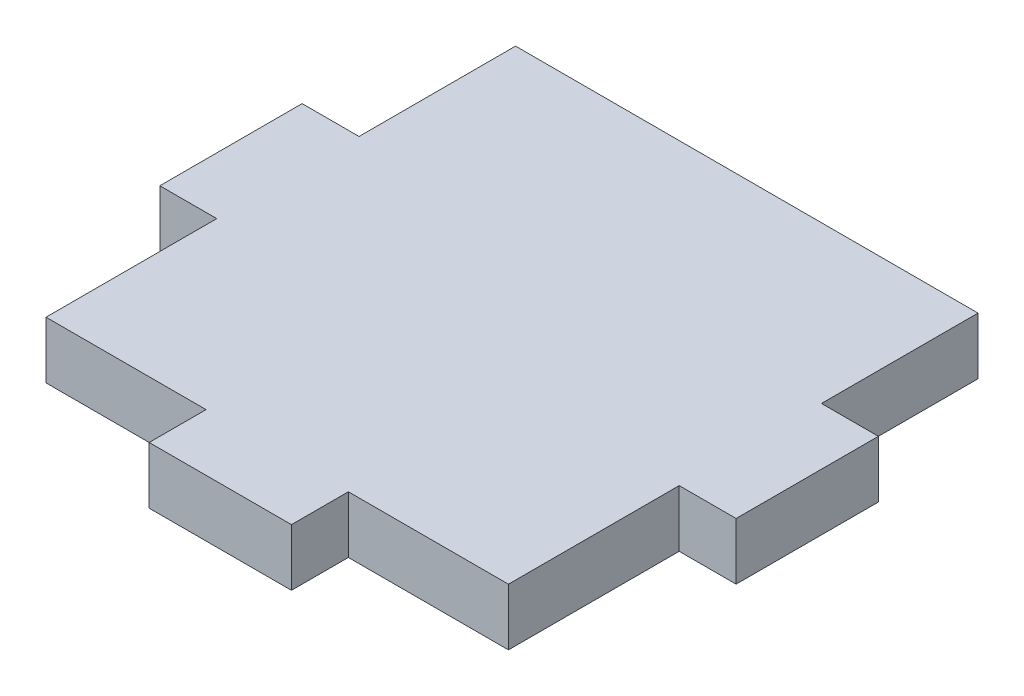
ISO-10303-21;
HEADER;
FILE_DESCRIPTION(('STEP AP214'),'2;1');
FILE_NAME('part.step','',(''),(''),'','','');
FILE_SCHEMA(('AUTOMOTIVE_DESIGN { 1 0 10303 214 1 1 1 1 }'));
ENDSEC;
DATA;
#1=APPLICATION_CONTEXT('core data for automotive mechanical design processes');
#2=APPLICATION_PROTOCOL_DEFINITION('international standard','automotive_design',2000,#1);
#3=PRODUCT_CONTEXT('',#1,'mechanical');
#4=PRODUCT('Part','Part','',(#3));
#5=PRODUCT_RELATED_PRODUCT_CATEGORY('part','',(#4));
#6=PRODUCT_DEFINITION_FORMATION('','',#4);
#7=PRODUCT_DEFINITION_CONTEXT('part definition',#1,'design');
#8=PRODUCT_DEFINITION('design','',#6,#7);
#9=PRODUCT_DEFINITION_SHAPE('','',#8);
#10=(LENGTH_UNIT() NAMED_UNIT(*) SI_UNIT(.MILLI.,.METRE.));
#11=(NAMED_UNIT(*) PLANE_ANGLE_UNIT() SI_UNIT($,.RADIAN.));
#12=(NAMED_UNIT(*) SI_UNIT($,.STERADIAN.) SOLID_ANGLE_UNIT());
#13=UNCERTAINTY_MEASURE_WITH_UNIT(LENGTH_MEASURE(1.E-05),#10,'distance_accuracy_value','');
#14=(GEOMETRIC_REPRESENTATION_CONTEXT(3) GLOBAL_UNCERTAINTY_ASSIGNED_CONTEXT((#13)) GLOBAL_UNIT_ASSIGNED_CONTEXT((#10,
#11,#12)) REPRESENTATION_CONTEXT('',''));
#15=CARTESIAN_POINT('',(0.,0.,0.));
#16=DIRECTION('',(0.,0.,1.));
#17=DIRECTION('',(1.,0.,0.));
#18=AXIS2_PLACEMENT_3D('',#15,#16,#17);
#19=CARTESIAN_POINT('',(0.,4.,0.));
#20=DIRECTION('',(1.,0.,0.));
#21=DIRECTION('',(0.,0.,-1.));
#22=AXIS2_PLACEMENT_3D('',#19,#20,#21);
#23=PLANE('',#22);
#24=DIRECTION('',(0.,-1.,0.));
#25=VECTOR('',#24,1.);
#26=CARTESIAN_POINT('',(0.,4.,11.));
#27=LINE('',#26,#25);
#28=CARTESIAN_POINT('',(0.,4.,11.));
#29=VERTEX_POINT('',#28);
#30=CARTESIAN_POINT('',(0.,0.,11.));
#31=VERTEX_POINT('',#30);
#32=EDGE_CURVE('E225',#29,#31,#27,.T.);
#33=ORIENTED_EDGE('',*,*,#32,.F.);
#34=DIRECTION('',(0.,0.,1.));
#35=VECTOR('',#34,1.);
#36=CARTESIAN_POINT('',(0.,4.,0.));
#37=LINE('',#36,#35);
#38=CARTESIAN_POINT('',(0.,4.,0.));
#39=VERTEX_POINT('',#38);
#40=EDGE_CURVE('E167',#39,#29,#37,.T.);
#41=ORIENTED_EDGE('',*,*,#40,.F.);
#42=DIRECTION('',(0.,-1.,0.));
#43=VECTOR('',#42,1.);
#44=CARTESIAN_POINT('',(0.,4.,0.));
#45=LINE('',#44,#43);
#46=CARTESIAN_POINT('',(0.,0.,0.));
#47=VERTEX_POINT('',#46);
#48=EDGE_CURVE('E185',#39,#47,#45,.T.);
#49=ORIENTED_EDGE('',*,*,#48,.T.);
#50=DIRECTION('',(0.,0.,1.));
#51=VECTOR('',#50,1.);
#52=CARTESIAN_POINT('',(0.,0.,0.));
#53=LINE('',#52,#51);
#54=EDGE_CURVE('E186',#47,#31,#53,.T.);
#55=ORIENTED_EDGE('',*,*,#54,.T.);
#56=EDGE_LOOP('',(#33,#41,#49,#55));
#57=FACE_BOUND('',#56,.T.);
#58=ADVANCED_FACE('F33',(#57),#23,.F.);
#59=CARTESIAN_POINT('',(32.5,4.,0.));
#60=DIRECTION('',(-1.,0.,0.));
#61=DIRECTION('',(0.,0.,1.));
#62=AXIS2_PLACEMENT_3D('',#59,#60,#61);
#63=PLANE('',#62);
#64=DIRECTION('',(0.,-1.,0.));
#65=VECTOR('',#64,1.);
#66=CARTESIAN_POINT('',(32.5,4.,21.));
#67=LINE('',#66,#65);
#68=CARTESIAN_POINT('',(32.5,4.,21.));
#69=VERTEX_POINT('',#68);
#70=CARTESIAN_POINT('',(32.5,0.,21.));
#71=VERTEX_POINT('',#70);
#72=EDGE_CURVE('E234',#69,#71,#67,.T.);
#73=ORIENTED_EDGE('',*,*,#72,.F.);
#74=DIRECTION('',(0.,0.,-1.));
#75=VECTOR('',#74,1.);
#76=CARTESIAN_POINT('',(32.5,4.,0.));
#77=LINE('',#76,#75);
#78=CARTESIAN_POINT('',(32.5,4.,33.));
#79=VERTEX_POINT('',#78);
#80=EDGE_CURVE('E180',#79,#69,#77,.T.);
#81=ORIENTED_EDGE('',*,*,#80,.F.);
#82=DIRECTION('',(0.,-1.,0.));
#83=VECTOR('',#82,1.);
#84=CARTESIAN_POINT('',(32.5,4.,33.));
#85=LINE('',#84,#83);
#86=CARTESIAN_POINT('',(32.5,0.,33.));
#87=VERTEX_POINT('',#86);
#88=EDGE_CURVE('E41',#79,#87,#85,.T.);
#89=ORIENTED_EDGE('',*,*,#88,.T.);
#90=DIRECTION('',(0.,0.,-1.));
#91=VECTOR('',#90,1.);
#92=CARTESIAN_POINT('',(32.5,0.,0.));
#93=LINE('',#92,#91);
#94=EDGE_CURVE('E171',#87,#71,#93,.T.);
#95=ORIENTED_EDGE('',*,*,#94,.T.);
#96=EDGE_LOOP('',(#73,#81,#89,#95));
#97=FACE_BOUND('',#96,.T.);
#98=ADVANCED_FACE('F207',(#97),#63,.F.);
#99=CARTESIAN_POINT('',(0.,4.,33.));
#100=DIRECTION('',(0.,0.,-1.));
#101=DIRECTION('',(-1.,0.,0.));
#102=AXIS2_PLACEMENT_3D('',#99,#100,#101);
#103=PLANE('',#102);
#104=DIRECTION('',(0.,-1.,0.));
#105=VECTOR('',#104,1.);
#106=CARTESIAN_POINT('',(11.25,4.,33.));
#107=LINE('',#106,#105);
#108=CARTESIAN_POINT('',(11.25,4.,33.));
#109=VERTEX_POINT('',#108);
#110=CARTESIAN_POINT('',(11.25,0.,33.));
#111=VERTEX_POINT('',#110);
#112=EDGE_CURVE('E257',#109,#111,#107,.T.);
#113=ORIENTED_EDGE('',*,*,#112,.F.);
#114=DIRECTION('',(1.,0.,0.));
#115=VECTOR('',#114,1.);
#116=CARTESIAN_POINT('',(0.,4.,33.));
#117=LINE('',#116,#115);
#118=CARTESIAN_POINT('',(0.,4.,33.));
#119=VERTEX_POINT('',#118);
#120=EDGE_CURVE('E177',#119,#109,#117,.T.);
#121=ORIENTED_EDGE('',*,*,#120,.F.);
#122=DIRECTION('',(0.,-1.,0.));
#123=VECTOR('',#122,1.);
#124=CARTESIAN_POINT('',(0.,4.,33.));
#125=LINE('',#124,#123);
#126=CARTESIAN_POINT('',(0.,0.,33.));
#127=VERTEX_POINT('',#126);
#128=EDGE_CURVE('E11',#119,#127,#125,.T.);
#129=ORIENTED_EDGE('',*,*,#128,.T.);
#130=DIRECTION('',(1.,0.,0.));
#131=VECTOR('',#130,1.);
#132=CARTESIAN_POINT('',(0.,0.,33.));
#133=LINE('',#132,#131);
#134=EDGE_CURVE('E191',#127,#111,#133,.T.);
#135=ORIENTED_EDGE('',*,*,#134,.T.);
#136=EDGE_LOOP('',(#113,#121,#129,#135));
#137=FACE_BOUND('',#136,.T.);
#138=ADVANCED_FACE('F271',(#137),#103,.F.);
#139=CARTESIAN_POINT('',(0.,4.,21.));
#140=VERTEX_POINT('',#139);
#141=EDGE_CURVE('E159',#140,#119,#37,.T.);
#142=ORIENTED_EDGE('',*,*,#141,.F.);
#143=DIRECTION('',(0.,-1.,0.));
#144=VECTOR('',#143,1.);
#145=CARTESIAN_POINT('',(0.,4.,21.));
#146=LINE('',#145,#144);
#147=CARTESIAN_POINT('',(0.,0.,21.));
#148=VERTEX_POINT('',#147);
#149=EDGE_CURVE('E144',#140,#148,#146,.T.);
#150=ORIENTED_EDGE('',*,*,#149,.T.);
#151=EDGE_CURVE('E190',#148,#127,#53,.T.);
#152=ORIENTED_EDGE('',*,*,#151,.T.);
#153=ORIENTED_EDGE('',*,*,#128,.F.);
#154=EDGE_LOOP('',(#142,#150,#152,#153));
#155=FACE_BOUND('',#154,.T.);
#156=ADVANCED_FACE('F35',(#155),#23,.F.);
#157=CARTESIAN_POINT('',(21.25,4.,33.));
#158=VERTEX_POINT('',#157);
#159=EDGE_CURVE('E170',#158,#79,#117,.T.);
#160=ORIENTED_EDGE('',*,*,#159,.F.);
#161=DIRECTION('',(0.,-1.,0.));
#162=VECTOR('',#161,1.);
#163=CARTESIAN_POINT('',(21.25,4.,33.));
#164=LINE('',#163,#162);
#165=CARTESIAN_POINT('',(21.25,0.,33.));
#166=VERTEX_POINT('',#165);
#167=EDGE_CURVE('E254',#158,#166,#164,.T.);
#168=ORIENTED_EDGE('',*,*,#167,.T.);
#169=EDGE_CURVE('E189',#166,#87,#133,.T.);
#170=ORIENTED_EDGE('',*,*,#169,.T.);
#171=ORIENTED_EDGE('',*,*,#88,.F.);
#172=EDGE_LOOP('',(#160,#168,#170,#171));
#173=FACE_BOUND('',#172,.T.);
#174=ADVANCED_FACE('F293',(#173),#103,.F.);
#175=CARTESIAN_POINT('',(32.5,4.,11.));
#176=VERTEX_POINT('',#175);
#177=CARTESIAN_POINT('',(32.5,4.,0.));
#178=VERTEX_POINT('',#177);
#179=EDGE_CURVE('E179',#176,#178,#77,.T.);
#180=ORIENTED_EDGE('',*,*,#179,.F.);
#181=DIRECTION('',(0.,-1.,0.));
#182=VECTOR('',#181,1.);
#183=CARTESIAN_POINT('',(32.5,4.,11.));
#184=LINE('',#183,#182);
#185=CARTESIAN_POINT('',(32.5,0.,11.));
#186=VERTEX_POINT('',#185);
#187=EDGE_CURVE('E232',#176,#186,#184,.T.);
#188=ORIENTED_EDGE('',*,*,#187,.T.);
#189=CARTESIAN_POINT('',(32.5,0.,0.));
#190=VERTEX_POINT('',#189);
#191=EDGE_CURVE('E194',#186,#190,#93,.T.);
#192=ORIENTED_EDGE('',*,*,#191,.T.);
#193=DIRECTION('',(0.,-1.,0.));
#194=VECTOR('',#193,1.);
#195=CARTESIAN_POINT('',(32.5,4.,0.));
#196=LINE('',#195,#194);
#197=EDGE_CURVE('E199',#178,#190,#196,.T.);
#198=ORIENTED_EDGE('',*,*,#197,.F.);
#199=EDGE_LOOP('',(#180,#188,#192,#198));
#200=FACE_BOUND('',#199,.T.);
#201=ADVANCED_FACE('F290',(#200),#63,.F.);
#202=CARTESIAN_POINT('',(0.,4.,0.));
#203=DIRECTION('',(0.,0.,1.));
#204=DIRECTION('',(1.,0.,0.));
#205=AXIS2_PLACEMENT_3D('',#202,#203,#204);
#206=PLANE('',#205);
#207=DIRECTION('',(-1.,0.,0.));
#208=VECTOR('',#207,1.);
#209=CARTESIAN_POINT('',(0.,0.,0.));
#210=LINE('',#209,#208);
#211=EDGE_CURVE('E168',#190,#47,#210,.T.);
#212=ORIENTED_EDGE('',*,*,#211,.T.);
#213=ORIENTED_EDGE('',*,*,#48,.F.);
#214=DIRECTION('',(-1.,0.,0.));
#215=VECTOR('',#214,1.);
#216=CARTESIAN_POINT('',(0.,4.,0.));
#217=LINE('',#216,#215);
#218=EDGE_CURVE('E183',#178,#39,#217,.T.);
#219=ORIENTED_EDGE('',*,*,#218,.F.);
#220=ORIENTED_EDGE('',*,*,#197,.T.);
#221=EDGE_LOOP('',(#212,#213,#219,#220));
#222=FACE_BOUND('',#221,.T.);
#223=ADVANCED_FACE('F302',(#222),#206,.F.);
#224=CARTESIAN_POINT('',(0.,4.,0.));
#225=DIRECTION('',(0.,1.,0.));
#226=DIRECTION('',(0.,0.,1.));
#227=AXIS2_PLACEMENT_3D('',#224,#225,#226);
#228=PLANE('',#227);
#229=ORIENTED_EDGE('',*,*,#40,.T.);
#230=DIRECTION('',(1.,0.,0.));
#231=VECTOR('',#230,1.);
#232=CARTESIAN_POINT('',(-4.,4.,11.));
#233=LINE('',#232,#231);
#234=CARTESIAN_POINT('',(-4.,4.,11.));
#235=VERTEX_POINT('',#234);
#236=EDGE_CURVE('E152',#235,#29,#233,.T.);
#237=ORIENTED_EDGE('',*,*,#236,.F.);
#238=DIRECTION('',(0.,0.,-1.));
#239=VECTOR('',#238,1.);
#240=CARTESIAN_POINT('',(-4.,4.,21.));
#241=LINE('',#240,#239);
#242=CARTESIAN_POINT('',(-4.,4.,21.));
#243=VERTEX_POINT('',#242);
#244=EDGE_CURVE('E163',#243,#235,#241,.T.);
#245=ORIENTED_EDGE('',*,*,#244,.F.);
#246=DIRECTION('',(-1.,0.,0.));
#247=VECTOR('',#246,1.);
#248=CARTESIAN_POINT('',(-4.,4.,21.));
#249=LINE('',#248,#247);
#250=EDGE_CURVE('E147',#140,#243,#249,.T.);
#251=ORIENTED_EDGE('',*,*,#250,.F.);
#252=ORIENTED_EDGE('',*,*,#141,.T.);
#253=ORIENTED_EDGE('',*,*,#120,.T.);
#254=DIRECTION('',(0.,0.,-1.));
#255=VECTOR('',#254,1.);
#256=CARTESIAN_POINT('',(11.25,4.,37.));
#257=LINE('',#256,#255);
#258=CARTESIAN_POINT('',(11.25,4.,37.));
#259=VERTEX_POINT('',#258);
#260=EDGE_CURVE('E246',#259,#109,#257,.T.);
#261=ORIENTED_EDGE('',*,*,#260,.F.);
#262=DIRECTION('',(-1.,0.,0.));
#263=VECTOR('',#262,1.);
#264=CARTESIAN_POINT('',(11.25,4.,37.));
#265=LINE('',#264,#263);
#266=CARTESIAN_POINT('',(21.25,4.,37.));
#267=VERTEX_POINT('',#266);
#268=EDGE_CURVE('E242',#267,#259,#265,.T.);
#269=ORIENTED_EDGE('',*,*,#268,.F.);
#270=DIRECTION('',(0.,0.,1.));
#271=VECTOR('',#270,1.);
#272=CARTESIAN_POINT('',(21.25,4.,37.));
#273=LINE('',#272,#271);
#274=EDGE_CURVE('E239',#158,#267,#273,.T.);
#275=ORIENTED_EDGE('',*,*,#274,.F.);
#276=ORIENTED_EDGE('',*,*,#159,.T.);
#277=ORIENTED_EDGE('',*,*,#80,.T.);
#278=DIRECTION('',(-1.,0.,0.));
#279=VECTOR('',#278,1.);
#280=CARTESIAN_POINT('',(32.5,4.,21.));
#281=LINE('',#280,#279);
#282=CARTESIAN_POINT('',(36.5,4.,21.));
#283=VERTEX_POINT('',#282);
#284=EDGE_CURVE('E408',#283,#69,#281,.T.);
#285=ORIENTED_EDGE('',*,*,#284,.F.);
#286=DIRECTION('',(0.,0.,1.));
#287=VECTOR('',#286,1.);
#288=CARTESIAN_POINT('',(36.5,4.,21.));
#289=LINE('',#288,#287);
#290=CARTESIAN_POINT('',(36.5,4.,11.));
#291=VERTEX_POINT('',#290);
#292=EDGE_CURVE('E223',#291,#283,#289,.T.);
#293=ORIENTED_EDGE('',*,*,#292,.F.);
#294=DIRECTION('',(1.,0.,0.));
#295=VECTOR('',#294,1.);
#296=CARTESIAN_POINT('',(32.5,4.,11.));
#297=LINE('',#296,#295);
#298=EDGE_CURVE('E238',#176,#291,#297,.T.);
#299=ORIENTED_EDGE('',*,*,#298,.F.);
#300=ORIENTED_EDGE('',*,*,#179,.T.);
#301=ORIENTED_EDGE('',*,*,#218,.T.);
#302=EDGE_LOOP('',(#229,#237,#245,#251,#252,#253,#261,#269,#275,#276,#277,#285,#293,#299,#300,#301));
#303=FACE_BOUND('',#302,.T.);
#304=ADVANCED_FACE('F157',(#303),#228,.T.);
#305=CARTESIAN_POINT('',(0.,0.,0.));
#306=DIRECTION('',(0.,1.,0.));
#307=DIRECTION('',(0.,0.,1.));
#308=AXIS2_PLACEMENT_3D('',#305,#306,#307);
#309=PLANE('',#308);
#310=ORIENTED_EDGE('',*,*,#54,.F.);
#311=ORIENTED_EDGE('',*,*,#211,.F.);
#312=ORIENTED_EDGE('',*,*,#191,.F.);
#313=DIRECTION('',(1.,0.,0.));
#314=VECTOR('',#313,1.);
#315=CARTESIAN_POINT('',(32.5,0.,11.));
#316=LINE('',#315,#314);
#317=CARTESIAN_POINT('',(36.5,0.,11.));
#318=VERTEX_POINT('',#317);
#319=EDGE_CURVE('E56',#186,#318,#316,.T.);
#320=ORIENTED_EDGE('',*,*,#319,.T.);
#321=DIRECTION('',(0.,0.,1.));
#322=VECTOR('',#321,1.);
#323=CARTESIAN_POINT('',(36.5,0.,21.));
#324=LINE('',#323,#322);
#325=CARTESIAN_POINT('',(36.5,0.,21.));
#326=VERTEX_POINT('',#325);
#327=EDGE_CURVE('E220',#318,#326,#324,.T.);
#328=ORIENTED_EDGE('',*,*,#327,.T.);
#329=DIRECTION('',(-1.,0.,0.));
#330=VECTOR('',#329,1.);
#331=CARTESIAN_POINT('',(32.5,0.,21.));
#332=LINE('',#331,#330);
#333=EDGE_CURVE('E218',#326,#71,#332,.T.);
#334=ORIENTED_EDGE('',*,*,#333,.T.);
#335=ORIENTED_EDGE('',*,*,#94,.F.);
#336=ORIENTED_EDGE('',*,*,#169,.F.);
#337=DIRECTION('',(0.,0.,1.));
#338=VECTOR('',#337,1.);
#339=CARTESIAN_POINT('',(21.25,0.,37.));
#340=LINE('',#339,#338);
#341=CARTESIAN_POINT('',(21.25,0.,37.));
#342=VERTEX_POINT('',#341);
#343=EDGE_CURVE('E231',#166,#342,#340,.T.);
#344=ORIENTED_EDGE('',*,*,#343,.T.);
#345=DIRECTION('',(-1.,0.,0.));
#346=VECTOR('',#345,1.);
#347=CARTESIAN_POINT('',(11.25,0.,37.));
#348=LINE('',#347,#346);
#349=CARTESIAN_POINT('',(11.25,0.,37.));
#350=VERTEX_POINT('',#349);
#351=EDGE_CURVE('E249',#342,#350,#348,.T.);
#352=ORIENTED_EDGE('',*,*,#351,.T.);
#353=DIRECTION('',(0.,0.,-1.));
#354=VECTOR('',#353,1.);
#355=CARTESIAN_POINT('',(11.25,0.,37.));
#356=LINE('',#355,#354);
#357=EDGE_CURVE('E243',#350,#111,#356,.T.);
#358=ORIENTED_EDGE('',*,*,#357,.T.);
#359=ORIENTED_EDGE('',*,*,#134,.F.);
#360=ORIENTED_EDGE('',*,*,#151,.F.);
#361=DIRECTION('',(-1.,0.,0.));
#362=VECTOR('',#361,1.);
#363=CARTESIAN_POINT('',(-4.,0.,21.));
#364=LINE('',#363,#362);
#365=CARTESIAN_POINT('',(-4.,0.,21.));
#366=VERTEX_POINT('',#365);
#367=EDGE_CURVE('E48',#148,#366,#364,.T.);
#368=ORIENTED_EDGE('',*,*,#367,.T.);
#369=DIRECTION('',(0.,0.,-1.));
#370=VECTOR('',#369,1.);
#371=CARTESIAN_POINT('',(-4.,0.,21.));
#372=LINE('',#371,#370);
#373=CARTESIAN_POINT('',(-4.,0.,11.));
#374=VERTEX_POINT('',#373);
#375=EDGE_CURVE('E393',#366,#374,#372,.T.);
#376=ORIENTED_EDGE('',*,*,#375,.T.);
#377=DIRECTION('',(1.,0.,0.));
#378=VECTOR('',#377,1.);
#379=CARTESIAN_POINT('',(-4.,0.,11.));
#380=LINE('',#379,#378);
#381=EDGE_CURVE('E164',#374,#31,#380,.T.);
#382=ORIENTED_EDGE('',*,*,#381,.T.);
#383=EDGE_LOOP('',(#310,#311,#312,#320,#328,#334,#335,#336,#344,#352,#358,#359,#360,#368,#376,#382));
#384=FACE_BOUND('',#383,.T.);
#385=ADVANCED_FACE('F214',(#384),#309,.F.);
#386=CARTESIAN_POINT('',(21.25,4.,37.));
#387=DIRECTION('',(1.,0.,0.));
#388=DIRECTION('',(0.,0.,-1.));
#389=AXIS2_PLACEMENT_3D('',#386,#387,#388);
#390=PLANE('',#389);
#391=ORIENTED_EDGE('',*,*,#343,.F.);
#392=ORIENTED_EDGE('',*,*,#167,.F.);
#393=ORIENTED_EDGE('',*,*,#274,.T.);
#394=DIRECTION('',(0.,-1.,0.));
#395=VECTOR('',#394,1.);
#396=CARTESIAN_POINT('',(21.25,4.,37.));
#397=LINE('',#396,#395);
#398=EDGE_CURVE('E175',#267,#342,#397,.T.);
#399=ORIENTED_EDGE('',*,*,#398,.T.);
#400=EDGE_LOOP('',(#391,#392,#393,#399));
#401=FACE_BOUND('',#400,.T.);
#402=ADVANCED_FACE('F263',(#401),#390,.T.);
#403=CARTESIAN_POINT('',(11.25,4.,37.));
#404=DIRECTION('',(-1.,0.,0.));
#405=DIRECTION('',(0.,0.,1.));
#406=AXIS2_PLACEMENT_3D('',#403,#404,#405);
#407=PLANE('',#406);
#408=ORIENTED_EDGE('',*,*,#357,.F.);
#409=DIRECTION('',(0.,-1.,0.));
#410=VECTOR('',#409,1.);
#411=CARTESIAN_POINT('',(11.25,4.,37.));
#412=LINE('',#411,#410);
#413=EDGE_CURVE('E258',#259,#350,#412,.T.);
#414=ORIENTED_EDGE('',*,*,#413,.F.);
#415=ORIENTED_EDGE('',*,*,#260,.T.);
#416=ORIENTED_EDGE('',*,*,#112,.T.);
#417=EDGE_LOOP('',(#408,#414,#415,#416));
#418=FACE_BOUND('',#417,.T.);
#419=ADVANCED_FACE('F273',(#418),#407,.T.);
#420=CARTESIAN_POINT('',(11.25,4.,37.));
#421=DIRECTION('',(0.,0.,1.));
#422=DIRECTION('',(1.,0.,0.));
#423=AXIS2_PLACEMENT_3D('',#420,#421,#422);
#424=PLANE('',#423);
#425=ORIENTED_EDGE('',*,*,#351,.F.);
#426=ORIENTED_EDGE('',*,*,#398,.F.);
#427=ORIENTED_EDGE('',*,*,#268,.T.);
#428=ORIENTED_EDGE('',*,*,#413,.T.);
#429=EDGE_LOOP('',(#425,#426,#427,#428));
#430=FACE_BOUND('',#429,.T.);
#431=ADVANCED_FACE('F266',(#430),#424,.T.);
#432=CARTESIAN_POINT('',(36.5,4.,21.));
#433=DIRECTION('',(1.,0.,0.));
#434=DIRECTION('',(0.,0.,-1.));
#435=AXIS2_PLACEMENT_3D('',#432,#433,#434);
#436=PLANE('',#435);
#437=ORIENTED_EDGE('',*,*,#327,.F.);
#438=DIRECTION('',(0.,-1.,0.));
#439=VECTOR('',#438,1.);
#440=CARTESIAN_POINT('',(36.5,4.,11.));
#441=LINE('',#440,#439);
#442=EDGE_CURVE('E229',#291,#318,#441,.T.);
#443=ORIENTED_EDGE('',*,*,#442,.F.);
#444=ORIENTED_EDGE('',*,*,#292,.T.);
#445=DIRECTION('',(0.,-1.,0.));
#446=VECTOR('',#445,1.);
#447=CARTESIAN_POINT('',(36.5,4.,21.));
#448=LINE('',#447,#446);
#449=EDGE_CURVE('E236',#283,#326,#448,.T.);
#450=ORIENTED_EDGE('',*,*,#449,.T.);
#451=EDGE_LOOP('',(#437,#443,#444,#450));
#452=FACE_BOUND('',#451,.T.);
#453=ADVANCED_FACE('F280',(#452),#436,.T.);
#454=CARTESIAN_POINT('',(32.5,4.,11.));
#455=DIRECTION('',(0.,0.,-1.));
#456=DIRECTION('',(-1.,0.,0.));
#457=AXIS2_PLACEMENT_3D('',#454,#455,#456);
#458=PLANE('',#457);
#459=ORIENTED_EDGE('',*,*,#319,.F.);
#460=ORIENTED_EDGE('',*,*,#187,.F.);
#461=ORIENTED_EDGE('',*,*,#298,.T.);
#462=ORIENTED_EDGE('',*,*,#442,.T.);
#463=EDGE_LOOP('',(#459,#460,#461,#462));
#464=FACE_BOUND('',#463,.T.);
#465=ADVANCED_FACE('F342',(#464),#458,.T.);
#466=CARTESIAN_POINT('',(32.5,4.,21.));
#467=DIRECTION('',(0.,0.,1.));
#468=DIRECTION('',(1.,0.,0.));
#469=AXIS2_PLACEMENT_3D('',#466,#467,#468);
#470=PLANE('',#469);
#471=ORIENTED_EDGE('',*,*,#333,.F.);
#472=ORIENTED_EDGE('',*,*,#449,.F.);
#473=ORIENTED_EDGE('',*,*,#284,.T.);
#474=ORIENTED_EDGE('',*,*,#72,.T.);
#475=EDGE_LOOP('',(#471,#472,#473,#474));
#476=FACE_BOUND('',#475,.T.);
#477=ADVANCED_FACE('F351',(#476),#470,.T.);
#478=CARTESIAN_POINT('',(-4.,4.,11.));
#479=DIRECTION('',(0.,0.,-1.));
#480=DIRECTION('',(-1.,0.,0.));
#481=AXIS2_PLACEMENT_3D('',#478,#479,#480);
#482=PLANE('',#481);
#483=ORIENTED_EDGE('',*,*,#381,.F.);
#484=DIRECTION('',(0.,-1.,0.));
#485=VECTOR('',#484,1.);
#486=CARTESIAN_POINT('',(-4.,4.,11.));
#487=LINE('',#486,#485);
#488=EDGE_CURVE('E394',#235,#374,#487,.T.);
#489=ORIENTED_EDGE('',*,*,#488,.F.);
#490=ORIENTED_EDGE('',*,*,#236,.T.);
#491=ORIENTED_EDGE('',*,*,#32,.T.);
#492=EDGE_LOOP('',(#483,#489,#490,#491));
#493=FACE_BOUND('',#492,.T.);
#494=ADVANCED_FACE('F360',(#493),#482,.T.);
#495=CARTESIAN_POINT('',(-4.,4.,21.));
#496=DIRECTION('',(-1.,0.,0.));
#497=DIRECTION('',(0.,0.,1.));
#498=AXIS2_PLACEMENT_3D('',#495,#496,#497);
#499=PLANE('',#498);
#500=ORIENTED_EDGE('',*,*,#375,.F.);
#501=DIRECTION('',(0.,-1.,0.));
#502=VECTOR('',#501,1.);
#503=CARTESIAN_POINT('',(-4.,4.,21.));
#504=LINE('',#503,#502);
#505=EDGE_CURVE('E151',#243,#366,#504,.T.);
#506=ORIENTED_EDGE('',*,*,#505,.F.);
#507=ORIENTED_EDGE('',*,*,#244,.T.);
#508=ORIENTED_EDGE('',*,*,#488,.T.);
#509=EDGE_LOOP('',(#500,#506,#507,#508));
#510=FACE_BOUND('',#509,.T.);
#511=ADVANCED_FACE('F369',(#510),#499,.T.);
#512=CARTESIAN_POINT('',(-4.,4.,21.));
#513=DIRECTION('',(0.,0.,1.));
#514=DIRECTION('',(1.,0.,0.));
#515=AXIS2_PLACEMENT_3D('',#512,#513,#514);
#516=PLANE('',#515);
#517=ORIENTED_EDGE('',*,*,#367,.F.);
#518=ORIENTED_EDGE('',*,*,#149,.F.);
#519=ORIENTED_EDGE('',*,*,#250,.T.);
#520=ORIENTED_EDGE('',*,*,#505,.T.);
#521=EDGE_LOOP('',(#517,#518,#519,#520));
#522=FACE_BOUND('',#521,.T.);
#523=ADVANCED_FACE('F146',(#522),#516,.T.);
#524=CLOSED_SHELL('',(#58,#98,#138,#156,#174,#201,#223,#304,#385,#402,#419,#431,#453,#465,#477,
#494,#511,#523));
#525=MANIFOLD_SOLID_BREP('B2',#524);
#526=ADVANCED_BREP_SHAPE_REPRESENTATION('',(#18,#525),#14);
#527=SHAPE_DEFINITION_REPRESENTATION(#9,#526);
ENDSEC;
END-ISO-10303-21;
